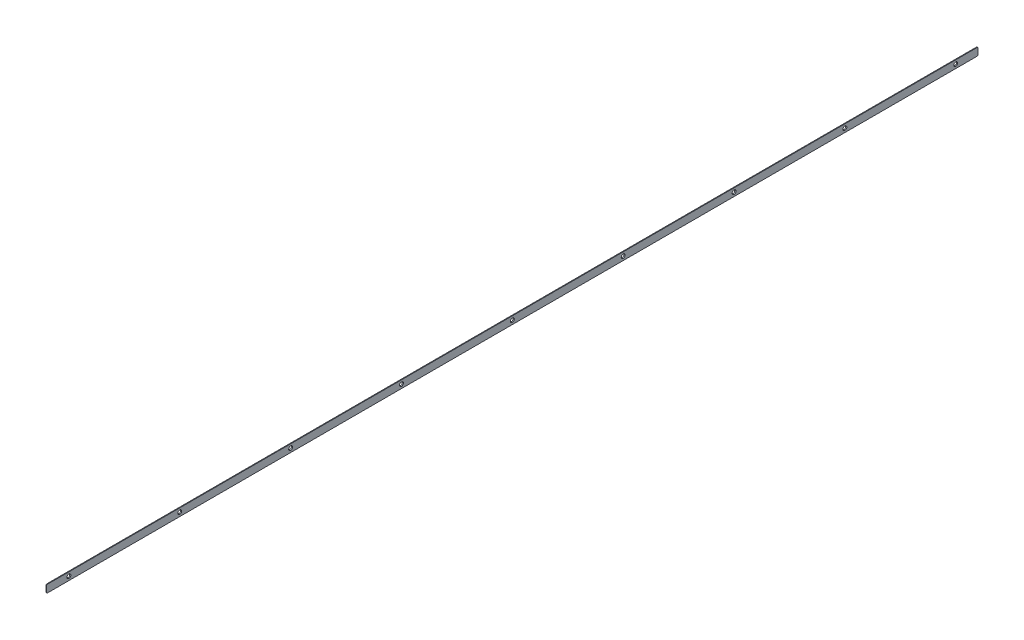
ISO-10303-21;
HEADER;
FILE_DESCRIPTION(('STEP AP214'),'2;1');
FILE_NAME('part.step','',(''),(''),'','','');
FILE_SCHEMA(('AUTOMOTIVE_DESIGN { 1 0 10303 214 1 1 1 1 }'));
ENDSEC;
DATA;
#1=APPLICATION_CONTEXT('core data for automotive mechanical design processes');
#2=APPLICATION_PROTOCOL_DEFINITION('international standard','automotive_design',2000,#1);
#3=PRODUCT_CONTEXT('',#1,'mechanical');
#4=PRODUCT('Part','Part','',(#3));
#5=PRODUCT_RELATED_PRODUCT_CATEGORY('part','',(#4));
#6=PRODUCT_DEFINITION_FORMATION('','',#4);
#7=PRODUCT_DEFINITION_CONTEXT('part definition',#1,'design');
#8=PRODUCT_DEFINITION('design','',#6,#7);
#9=PRODUCT_DEFINITION_SHAPE('','',#8);
#10=(LENGTH_UNIT() NAMED_UNIT(*) SI_UNIT(.MILLI.,.METRE.));
#11=(NAMED_UNIT(*) PLANE_ANGLE_UNIT() SI_UNIT($,.RADIAN.));
#12=(NAMED_UNIT(*) SI_UNIT($,.STERADIAN.) SOLID_ANGLE_UNIT());
#13=UNCERTAINTY_MEASURE_WITH_UNIT(LENGTH_MEASURE(1.E-05),#10,'distance_accuracy_value','');
#14=(GEOMETRIC_REPRESENTATION_CONTEXT(3) GLOBAL_UNCERTAINTY_ASSIGNED_CONTEXT((#13)) GLOBAL_UNIT_ASSIGNED_CONTEXT((#10,
#11,#12)) REPRESENTATION_CONTEXT('',''));
#15=CARTESIAN_POINT('',(0.,0.,0.));
#16=DIRECTION('',(0.,0.,1.));
#17=DIRECTION('',(1.,0.,0.));
#18=AXIS2_PLACEMENT_3D('',#15,#16,#17);
#19=CARTESIAN_POINT('',(0.,0.,0.));
#20=DIRECTION('',(1.,0.,0.));
#21=DIRECTION('',(0.,0.,-1.));
#22=AXIS2_PLACEMENT_3D('',#19,#20,#21);
#23=PLANE('',#22);
#24=CARTESIAN_POINT('',(0.,0.,-498.));
#25=DIRECTION('',(1.,0.,0.));
#26=DIRECTION('',(0.,0.,-1.));
#27=AXIS2_PLACEMENT_3D('',#24,#25,#26);
#28=CIRCLE('',#27,1.52200350578404);
#29=CARTESIAN_POINT('',(0.,0.,-499.522003505784));
#30=VERTEX_POINT('',#29);
#31=EDGE_CURVE('E222',#30,#30,#28,.T.);
#32=ORIENTED_EDGE('',*,*,#31,.T.);
#33=EDGE_LOOP('',(#32));
#34=FACE_BOUND('',#33,.T.);
#35=CARTESIAN_POINT('',(0.,0.,-249.));
#36=DIRECTION('',(1.,0.,0.));
#37=DIRECTION('',(0.,0.,-1.));
#38=AXIS2_PLACEMENT_3D('',#35,#36,#37);
#39=CIRCLE('',#38,1.52200350578404);
#40=CARTESIAN_POINT('',(0.,0.,-250.522003505784));
#41=VERTEX_POINT('',#40);
#42=EDGE_CURVE('E210',#41,#41,#39,.T.);
#43=ORIENTED_EDGE('',*,*,#42,.T.);
#44=EDGE_LOOP('',(#43));
#45=FACE_BOUND('',#44,.T.);
#46=CARTESIAN_POINT('',(0.,0.,0.));
#47=DIRECTION('',(1.,0.,0.));
#48=DIRECTION('',(0.,0.,-1.));
#49=AXIS2_PLACEMENT_3D('',#46,#47,#48);
#50=CIRCLE('',#49,1.52200350578404);
#51=CARTESIAN_POINT('',(0.,0.,-1.52200350578404));
#52=VERTEX_POINT('',#51);
#53=EDGE_CURVE('E198',#52,#52,#50,.T.);
#54=ORIENTED_EDGE('',*,*,#53,.T.);
#55=EDGE_LOOP('',(#54));
#56=FACE_BOUND('',#55,.T.);
#57=CARTESIAN_POINT('',(0.,0.,249.));
#58=DIRECTION('',(1.,0.,0.));
#59=DIRECTION('',(0.,0.,-1.));
#60=AXIS2_PLACEMENT_3D('',#57,#58,#59);
#61=CIRCLE('',#60,1.52200350578404);
#62=CARTESIAN_POINT('',(0.,0.,247.477996494216));
#63=VERTEX_POINT('',#62);
#64=EDGE_CURVE('E139',#63,#63,#61,.T.);
#65=ORIENTED_EDGE('',*,*,#64,.T.);
#66=EDGE_LOOP('',(#65));
#67=FACE_BOUND('',#66,.T.);
#68=CARTESIAN_POINT('',(0.,0.,498.));
#69=DIRECTION('',(1.,0.,0.));
#70=DIRECTION('',(0.,0.,-1.));
#71=AXIS2_PLACEMENT_3D('',#68,#69,#70);
#72=CIRCLE('',#71,1.52200350578404);
#73=CARTESIAN_POINT('',(0.,0.,496.477996494216));
#74=VERTEX_POINT('',#73);
#75=EDGE_CURVE('E130',#74,#74,#72,.T.);
#76=ORIENTED_EDGE('',*,*,#75,.T.);
#77=EDGE_LOOP('',(#76));
#78=FACE_BOUND('',#77,.T.);
#79=DIRECTION('',(0.,0.,1.));
#80=VECTOR('',#79,1.);
#81=CARTESIAN_POINT('',(0.,4.2705,523.));
#82=LINE('',#81,#80);
#83=CARTESIAN_POINT('',(0.,4.2705,-522.));
#84=VERTEX_POINT('',#83);
#85=CARTESIAN_POINT('',(0.,4.2705,522.));
#86=VERTEX_POINT('',#85);
#87=EDGE_CURVE('E115',#84,#86,#82,.T.);
#88=ORIENTED_EDGE('',*,*,#87,.F.);
#89=CARTESIAN_POINT('',(0.,3.2705,-522.));
#90=DIRECTION('',(1.,0.,0.));
#91=DIRECTION('',(0.,0.,-1.));
#92=AXIS2_PLACEMENT_3D('',#89,#90,#91);
#93=CIRCLE('',#92,1.);
#94=CARTESIAN_POINT('',(0.,3.2705,-523.));
#95=VERTEX_POINT('',#94);
#96=EDGE_CURVE('E98',#84,#95,#93,.F.);
#97=ORIENTED_EDGE('',*,*,#96,.T.);
#98=DIRECTION('',(0.,1.,0.));
#99=VECTOR('',#98,1.);
#100=CARTESIAN_POINT('',(0.,4.2705,-523.));
#101=LINE('',#100,#99);
#102=CARTESIAN_POINT('',(0.,-3.2705,-523.));
#103=VERTEX_POINT('',#102);
#104=EDGE_CURVE('E125',#103,#95,#101,.T.);
#105=ORIENTED_EDGE('',*,*,#104,.F.);
#106=CARTESIAN_POINT('',(0.,-3.2705,-522.));
#107=DIRECTION('',(1.,0.,0.));
#108=DIRECTION('',(0.,0.,-1.));
#109=AXIS2_PLACEMENT_3D('',#106,#107,#108);
#110=CIRCLE('',#109,1.);
#111=CARTESIAN_POINT('',(0.,-4.2705,-522.));
#112=VERTEX_POINT('',#111);
#113=EDGE_CURVE('E109',#103,#112,#110,.F.);
#114=ORIENTED_EDGE('',*,*,#113,.T.);
#115=DIRECTION('',(0.,0.,-1.));
#116=VECTOR('',#115,1.);
#117=CARTESIAN_POINT('',(0.,-4.2705,523.));
#118=LINE('',#117,#116);
#119=CARTESIAN_POINT('',(0.,-4.2705,522.));
#120=VERTEX_POINT('',#119);
#121=EDGE_CURVE('E128',#120,#112,#118,.T.);
#122=ORIENTED_EDGE('',*,*,#121,.F.);
#123=CARTESIAN_POINT('',(0.,-3.2705,522.));
#124=DIRECTION('',(1.,0.,0.));
#125=DIRECTION('',(0.,0.,-1.));
#126=AXIS2_PLACEMENT_3D('',#123,#124,#125);
#127=CIRCLE('',#126,1.);
#128=CARTESIAN_POINT('',(0.,-3.2705,523.));
#129=VERTEX_POINT('',#128);
#130=EDGE_CURVE('E151',#120,#129,#127,.F.);
#131=ORIENTED_EDGE('',*,*,#130,.T.);
#132=DIRECTION('',(0.,-1.,0.));
#133=VECTOR('',#132,1.);
#134=CARTESIAN_POINT('',(0.,4.2705,523.));
#135=LINE('',#134,#133);
#136=CARTESIAN_POINT('',(0.,3.2705,523.));
#137=VERTEX_POINT('',#136);
#138=EDGE_CURVE('E124',#137,#129,#135,.T.);
#139=ORIENTED_EDGE('',*,*,#138,.F.);
#140=CARTESIAN_POINT('',(0.,3.2705,522.));
#141=DIRECTION('',(1.,0.,0.));
#142=DIRECTION('',(0.,0.,-1.));
#143=AXIS2_PLACEMENT_3D('',#140,#141,#142);
#144=CIRCLE('',#143,1.);
#145=EDGE_CURVE('E119',#137,#86,#144,.F.);
#146=ORIENTED_EDGE('',*,*,#145,.T.);
#147=EDGE_LOOP('',(#88,#97,#105,#114,#122,#131,#139,#146));
#148=FACE_BOUND('',#147,.T.);
#149=CARTESIAN_POINT('',(0.,0.,373.5));
#150=DIRECTION('',(1.,0.,0.));
#151=DIRECTION('',(0.,0.,-1.));
#152=AXIS2_PLACEMENT_3D('',#149,#150,#151);
#153=CIRCLE('',#152,1.52200350578404);
#154=CARTESIAN_POINT('',(0.,0.,371.977996494216));
#155=VERTEX_POINT('',#154);
#156=EDGE_CURVE('E189',#155,#155,#153,.T.);
#157=ORIENTED_EDGE('',*,*,#156,.T.);
#158=EDGE_LOOP('',(#157));
#159=FACE_BOUND('',#158,.T.);
#160=CARTESIAN_POINT('',(0.,0.,124.5));
#161=DIRECTION('',(1.,0.,0.));
#162=DIRECTION('',(0.,0.,-1.));
#163=AXIS2_PLACEMENT_3D('',#160,#161,#162);
#164=CIRCLE('',#163,1.52200350578404);
#165=CARTESIAN_POINT('',(0.,0.,122.977996494216));
#166=VERTEX_POINT('',#165);
#167=EDGE_CURVE('E144',#166,#166,#164,.T.);
#168=ORIENTED_EDGE('',*,*,#167,.T.);
#169=EDGE_LOOP('',(#168));
#170=FACE_BOUND('',#169,.T.);
#171=CARTESIAN_POINT('',(0.,0.,-124.5));
#172=DIRECTION('',(1.,0.,0.));
#173=DIRECTION('',(0.,0.,-1.));
#174=AXIS2_PLACEMENT_3D('',#171,#172,#173);
#175=CIRCLE('',#174,1.52200350578404);
#176=CARTESIAN_POINT('',(0.,0.,-126.022003505784));
#177=VERTEX_POINT('',#176);
#178=EDGE_CURVE('E204',#177,#177,#175,.T.);
#179=ORIENTED_EDGE('',*,*,#178,.T.);
#180=EDGE_LOOP('',(#179));
#181=FACE_BOUND('',#180,.T.);
#182=CARTESIAN_POINT('',(0.,0.,-373.5));
#183=DIRECTION('',(1.,0.,0.));
#184=DIRECTION('',(0.,0.,-1.));
#185=AXIS2_PLACEMENT_3D('',#182,#183,#184);
#186=CIRCLE('',#185,1.52200350578404);
#187=CARTESIAN_POINT('',(0.,0.,-375.022003505784));
#188=VERTEX_POINT('',#187);
#189=EDGE_CURVE('E216',#188,#188,#186,.T.);
#190=ORIENTED_EDGE('',*,*,#189,.T.);
#191=EDGE_LOOP('',(#190));
#192=FACE_BOUND('',#191,.T.);
#193=ADVANCED_FACE('F32',(#34,#45,#56,#67,#78,#148,#159,#170,#181,#192),#23,.F.);
#194=CARTESIAN_POINT('',(0.762,4.2705,-523.));
#195=DIRECTION('',(0.,0.,1.));
#196=DIRECTION('',(1.,0.,0.));
#197=AXIS2_PLACEMENT_3D('',#194,#195,#196);
#198=PLANE('',#197);
#199=ORIENTED_EDGE('',*,*,#104,.T.);
#200=DIRECTION('',(-1.,0.,0.));
#201=VECTOR('',#200,1.);
#202=CARTESIAN_POINT('',(0.762,3.2705,-523.));
#203=LINE('',#202,#201);
#204=CARTESIAN_POINT('',(0.762,3.2705,-523.));
#205=VERTEX_POINT('',#204);
#206=EDGE_CURVE('E103',#95,#205,#203,.F.);
#207=ORIENTED_EDGE('',*,*,#206,.T.);
#208=DIRECTION('',(0.,1.,0.));
#209=VECTOR('',#208,1.);
#210=CARTESIAN_POINT('',(0.762,4.2705,-523.));
#211=LINE('',#210,#209);
#212=CARTESIAN_POINT('',(0.762,-3.2705,-523.));
#213=VERTEX_POINT('',#212);
#214=EDGE_CURVE('E135',#213,#205,#211,.T.);
#215=ORIENTED_EDGE('',*,*,#214,.F.);
#216=DIRECTION('',(-1.,0.,0.));
#217=VECTOR('',#216,1.);
#218=CARTESIAN_POINT('',(0.762,-3.2705,-523.));
#219=LINE('',#218,#217);
#220=EDGE_CURVE('E108',#213,#103,#219,.T.);
#221=ORIENTED_EDGE('',*,*,#220,.T.);
#222=EDGE_LOOP('',(#199,#207,#215,#221));
#223=FACE_BOUND('',#222,.T.);
#224=ADVANCED_FACE('F255',(#223),#198,.F.);
#225=CARTESIAN_POINT('',(0.762,4.2705,523.));
#226=DIRECTION('',(0.,-1.,0.));
#227=DIRECTION('',(0.,0.,-1.));
#228=AXIS2_PLACEMENT_3D('',#225,#226,#227);
#229=PLANE('',#228);
#230=DIRECTION('',(0.,0.,1.));
#231=VECTOR('',#230,1.);
#232=CARTESIAN_POINT('',(0.762,4.2705,523.));
#233=LINE('',#232,#231);
#234=CARTESIAN_POINT('',(0.762,4.2705,-522.));
#235=VERTEX_POINT('',#234);
#236=CARTESIAN_POINT('',(0.762,4.2705,522.));
#237=VERTEX_POINT('',#236);
#238=EDGE_CURVE('E118',#235,#237,#233,.T.);
#239=ORIENTED_EDGE('',*,*,#238,.F.);
#240=DIRECTION('',(-1.,0.,0.));
#241=VECTOR('',#240,1.);
#242=CARTESIAN_POINT('',(0.762,4.2705,-522.));
#243=LINE('',#242,#241);
#244=EDGE_CURVE('E102',#235,#84,#243,.T.);
#245=ORIENTED_EDGE('',*,*,#244,.T.);
#246=ORIENTED_EDGE('',*,*,#87,.T.);
#247=DIRECTION('',(-1.,0.,0.));
#248=VECTOR('',#247,1.);
#249=CARTESIAN_POINT('',(0.762,4.2705,522.));
#250=LINE('',#249,#248);
#251=EDGE_CURVE('E120',#86,#237,#250,.F.);
#252=ORIENTED_EDGE('',*,*,#251,.T.);
#253=EDGE_LOOP('',(#239,#245,#246,#252));
#254=FACE_BOUND('',#253,.T.);
#255=ADVANCED_FACE('F114',(#254),#229,.F.);
#256=CARTESIAN_POINT('',(0.762,4.2705,523.));
#257=DIRECTION('',(0.,0.,-1.));
#258=DIRECTION('',(-1.,0.,0.));
#259=AXIS2_PLACEMENT_3D('',#256,#257,#258);
#260=PLANE('',#259);
#261=ORIENTED_EDGE('',*,*,#138,.T.);
#262=DIRECTION('',(-1.,0.,0.));
#263=VECTOR('',#262,1.);
#264=CARTESIAN_POINT('',(0.762,-3.2705,523.));
#265=LINE('',#264,#263);
#266=CARTESIAN_POINT('',(0.762,-3.2705,523.));
#267=VERTEX_POINT('',#266);
#268=EDGE_CURVE('E11',#129,#267,#265,.F.);
#269=ORIENTED_EDGE('',*,*,#268,.T.);
#270=DIRECTION('',(0.,-1.,0.));
#271=VECTOR('',#270,1.);
#272=CARTESIAN_POINT('',(0.762,4.2705,523.));
#273=LINE('',#272,#271);
#274=CARTESIAN_POINT('',(0.762,3.2705,523.));
#275=VERTEX_POINT('',#274);
#276=EDGE_CURVE('E173',#275,#267,#273,.T.);
#277=ORIENTED_EDGE('',*,*,#276,.F.);
#278=DIRECTION('',(-1.,0.,0.));
#279=VECTOR('',#278,1.);
#280=CARTESIAN_POINT('',(0.762,3.2705,523.));
#281=LINE('',#280,#279);
#282=EDGE_CURVE('E40',#275,#137,#281,.T.);
#283=ORIENTED_EDGE('',*,*,#282,.T.);
#284=EDGE_LOOP('',(#261,#269,#277,#283));
#285=FACE_BOUND('',#284,.T.);
#286=ADVANCED_FACE('F171',(#285),#260,.F.);
#287=CARTESIAN_POINT('',(0.762,-4.2705,523.));
#288=DIRECTION('',(0.,1.,0.));
#289=DIRECTION('',(0.,0.,1.));
#290=AXIS2_PLACEMENT_3D('',#287,#288,#289);
#291=PLANE('',#290);
#292=ORIENTED_EDGE('',*,*,#121,.T.);
#293=DIRECTION('',(-1.,0.,0.));
#294=VECTOR('',#293,1.);
#295=CARTESIAN_POINT('',(0.762,-4.2705,-522.));
#296=LINE('',#295,#294);
#297=CARTESIAN_POINT('',(0.762,-4.2705,-522.));
#298=VERTEX_POINT('',#297);
#299=EDGE_CURVE('E47',#112,#298,#296,.F.);
#300=ORIENTED_EDGE('',*,*,#299,.T.);
#301=DIRECTION('',(0.,0.,-1.));
#302=VECTOR('',#301,1.);
#303=CARTESIAN_POINT('',(0.762,-4.2705,523.));
#304=LINE('',#303,#302);
#305=CARTESIAN_POINT('',(0.762,-4.2705,522.));
#306=VERTEX_POINT('',#305);
#307=EDGE_CURVE('E148',#306,#298,#304,.T.);
#308=ORIENTED_EDGE('',*,*,#307,.F.);
#309=DIRECTION('',(-1.,0.,0.));
#310=VECTOR('',#309,1.);
#311=CARTESIAN_POINT('',(0.762,-4.2705,522.));
#312=LINE('',#311,#310);
#313=EDGE_CURVE('E164',#306,#120,#312,.T.);
#314=ORIENTED_EDGE('',*,*,#313,.T.);
#315=EDGE_LOOP('',(#292,#300,#308,#314));
#316=FACE_BOUND('',#315,.T.);
#317=ADVANCED_FACE('F180',(#316),#291,.F.);
#318=CARTESIAN_POINT('',(0.762,0.,0.));
#319=DIRECTION('',(1.,0.,0.));
#320=DIRECTION('',(0.,0.,-1.));
#321=AXIS2_PLACEMENT_3D('',#318,#319,#320);
#322=PLANE('',#321);
#323=CARTESIAN_POINT('',(0.762,0.,-498.));
#324=DIRECTION('',(1.,0.,0.));
#325=DIRECTION('',(0.,0.,-1.));
#326=AXIS2_PLACEMENT_3D('',#323,#324,#325);
#327=CIRCLE('',#326,2.1844);
#328=CARTESIAN_POINT('',(0.762,0.,-500.1844));
#329=VERTEX_POINT('',#328);
#330=EDGE_CURVE('E225',#329,#329,#327,.T.);
#331=ORIENTED_EDGE('',*,*,#330,.F.);
#332=EDGE_LOOP('',(#331));
#333=FACE_BOUND('',#332,.T.);
#334=CARTESIAN_POINT('',(0.762,0.,-373.5));
#335=DIRECTION('',(1.,0.,0.));
#336=DIRECTION('',(0.,0.,-1.));
#337=AXIS2_PLACEMENT_3D('',#334,#335,#336);
#338=CIRCLE('',#337,2.1844);
#339=CARTESIAN_POINT('',(0.762,0.,-375.6844));
#340=VERTEX_POINT('',#339);
#341=EDGE_CURVE('E219',#340,#340,#338,.T.);
#342=ORIENTED_EDGE('',*,*,#341,.F.);
#343=EDGE_LOOP('',(#342));
#344=FACE_BOUND('',#343,.T.);
#345=CARTESIAN_POINT('',(0.762,0.,-249.));
#346=DIRECTION('',(1.,0.,0.));
#347=DIRECTION('',(0.,0.,-1.));
#348=AXIS2_PLACEMENT_3D('',#345,#346,#347);
#349=CIRCLE('',#348,2.1844);
#350=CARTESIAN_POINT('',(0.762,0.,-251.1844));
#351=VERTEX_POINT('',#350);
#352=EDGE_CURVE('E213',#351,#351,#349,.T.);
#353=ORIENTED_EDGE('',*,*,#352,.F.);
#354=EDGE_LOOP('',(#353));
#355=FACE_BOUND('',#354,.T.);
#356=CARTESIAN_POINT('',(0.762,0.,-124.5));
#357=DIRECTION('',(1.,0.,0.));
#358=DIRECTION('',(0.,0.,-1.));
#359=AXIS2_PLACEMENT_3D('',#356,#357,#358);
#360=CIRCLE('',#359,2.1844);
#361=CARTESIAN_POINT('',(0.762,0.,-126.6844));
#362=VERTEX_POINT('',#361);
#363=EDGE_CURVE('E207',#362,#362,#360,.T.);
#364=ORIENTED_EDGE('',*,*,#363,.F.);
#365=EDGE_LOOP('',(#364));
#366=FACE_BOUND('',#365,.T.);
#367=CARTESIAN_POINT('',(0.762,0.,0.));
#368=DIRECTION('',(1.,0.,0.));
#369=DIRECTION('',(0.,0.,-1.));
#370=AXIS2_PLACEMENT_3D('',#367,#368,#369);
#371=CIRCLE('',#370,2.1844);
#372=CARTESIAN_POINT('',(0.762,0.,-2.1844));
#373=VERTEX_POINT('',#372);
#374=EDGE_CURVE('E201',#373,#373,#371,.T.);
#375=ORIENTED_EDGE('',*,*,#374,.F.);
#376=EDGE_LOOP('',(#375));
#377=FACE_BOUND('',#376,.T.);
#378=CARTESIAN_POINT('',(0.762,0.,124.5));
#379=DIRECTION('',(1.,0.,0.));
#380=DIRECTION('',(0.,0.,-1.));
#381=AXIS2_PLACEMENT_3D('',#378,#379,#380);
#382=CIRCLE('',#381,2.1844);
#383=CARTESIAN_POINT('',(0.762,0.,122.3156));
#384=VERTEX_POINT('',#383);
#385=EDGE_CURVE('E147',#384,#384,#382,.T.);
#386=ORIENTED_EDGE('',*,*,#385,.F.);
#387=EDGE_LOOP('',(#386));
#388=FACE_BOUND('',#387,.T.);
#389=CARTESIAN_POINT('',(0.762,0.,249.));
#390=DIRECTION('',(1.,0.,0.));
#391=DIRECTION('',(0.,0.,-1.));
#392=AXIS2_PLACEMENT_3D('',#389,#390,#391);
#393=CIRCLE('',#392,2.1844);
#394=CARTESIAN_POINT('',(0.762,0.,246.8156));
#395=VERTEX_POINT('',#394);
#396=EDGE_CURVE('E143',#395,#395,#393,.T.);
#397=ORIENTED_EDGE('',*,*,#396,.F.);
#398=EDGE_LOOP('',(#397));
#399=FACE_BOUND('',#398,.T.);
#400=CARTESIAN_POINT('',(0.762,0.,373.5));
#401=DIRECTION('',(1.,0.,0.));
#402=DIRECTION('',(0.,0.,-1.));
#403=AXIS2_PLACEMENT_3D('',#400,#401,#402);
#404=CIRCLE('',#403,2.1844);
#405=CARTESIAN_POINT('',(0.762,0.,371.3156));
#406=VERTEX_POINT('',#405);
#407=EDGE_CURVE('E142',#406,#406,#404,.T.);
#408=ORIENTED_EDGE('',*,*,#407,.F.);
#409=EDGE_LOOP('',(#408));
#410=FACE_BOUND('',#409,.T.);
#411=CARTESIAN_POINT('',(0.762,0.,498.));
#412=DIRECTION('',(1.,0.,0.));
#413=DIRECTION('',(0.,0.,-1.));
#414=AXIS2_PLACEMENT_3D('',#411,#412,#413);
#415=CIRCLE('',#414,2.1844);
#416=CARTESIAN_POINT('',(0.762,0.,495.8156));
#417=VERTEX_POINT('',#416);
#418=EDGE_CURVE('E138',#417,#417,#415,.T.);
#419=ORIENTED_EDGE('',*,*,#418,.F.);
#420=EDGE_LOOP('',(#419));
#421=FACE_BOUND('',#420,.T.);
#422=ORIENTED_EDGE('',*,*,#214,.T.);
#423=CARTESIAN_POINT('',(0.762,3.2705,-522.));
#424=DIRECTION('',(1.,0.,0.));
#425=DIRECTION('',(0.,0.,-1.));
#426=AXIS2_PLACEMENT_3D('',#423,#424,#425);
#427=CIRCLE('',#426,1.);
#428=EDGE_CURVE('E162',#205,#235,#427,.T.);
#429=ORIENTED_EDGE('',*,*,#428,.T.);
#430=ORIENTED_EDGE('',*,*,#238,.T.);
#431=CARTESIAN_POINT('',(0.762,3.2705,522.));
#432=DIRECTION('',(1.,0.,0.));
#433=DIRECTION('',(0.,0.,-1.));
#434=AXIS2_PLACEMENT_3D('',#431,#432,#433);
#435=CIRCLE('',#434,1.);
#436=EDGE_CURVE('E157',#237,#275,#435,.T.);
#437=ORIENTED_EDGE('',*,*,#436,.T.);
#438=ORIENTED_EDGE('',*,*,#276,.T.);
#439=CARTESIAN_POINT('',(0.762,-3.2705,522.));
#440=DIRECTION('',(1.,0.,0.));
#441=DIRECTION('',(0.,0.,-1.));
#442=AXIS2_PLACEMENT_3D('',#439,#440,#441);
#443=CIRCLE('',#442,1.);
#444=EDGE_CURVE('E54',#267,#306,#443,.T.);
#445=ORIENTED_EDGE('',*,*,#444,.T.);
#446=ORIENTED_EDGE('',*,*,#307,.T.);
#447=CARTESIAN_POINT('',(0.762,-3.2705,-522.));
#448=DIRECTION('',(1.,0.,0.));
#449=DIRECTION('',(0.,0.,-1.));
#450=AXIS2_PLACEMENT_3D('',#447,#448,#449);
#451=CIRCLE('',#450,1.);
#452=EDGE_CURVE('E160',#298,#213,#451,.T.);
#453=ORIENTED_EDGE('',*,*,#452,.T.);
#454=EDGE_LOOP('',(#422,#429,#430,#437,#438,#445,#446,#453));
#455=FACE_BOUND('',#454,.T.);
#456=ADVANCED_FACE('F232',(#333,#344,#355,#366,#377,#388,#399,#410,#421,#455),#322,.T.);
#457=CARTESIAN_POINT('',(0.762,0.,498.));
#458=DIRECTION('',(1.,0.,0.));
#459=DIRECTION('',(0.,0.,-1.));
#460=AXIS2_PLACEMENT_3D('',#457,#458,#459);
#461=CONICAL_SURFACE('',#460,2.1844,0.715584993317675);
#462=ORIENTED_EDGE('',*,*,#418,.T.);
#463=EDGE_LOOP('',(#462));
#464=FACE_BOUND('',#463,.T.);
#465=ORIENTED_EDGE('',*,*,#75,.F.);
#466=EDGE_LOOP('',(#465));
#467=FACE_BOUND('',#466,.T.);
#468=ADVANCED_FACE('F235',(#464,#467),#461,.F.);
#469=CARTESIAN_POINT('',(0.762,0.,373.5));
#470=DIRECTION('',(1.,0.,0.));
#471=DIRECTION('',(0.,0.,-1.));
#472=AXIS2_PLACEMENT_3D('',#469,#470,#471);
#473=CONICAL_SURFACE('',#472,2.1844,0.715584993317675);
#474=ORIENTED_EDGE('',*,*,#407,.T.);
#475=EDGE_LOOP('',(#474));
#476=FACE_BOUND('',#475,.T.);
#477=ORIENTED_EDGE('',*,*,#156,.F.);
#478=EDGE_LOOP('',(#477));
#479=FACE_BOUND('',#478,.T.);
#480=ADVANCED_FACE('F303',(#476,#479),#473,.F.);
#481=CARTESIAN_POINT('',(0.762,0.,249.));
#482=DIRECTION('',(1.,0.,0.));
#483=DIRECTION('',(0.,0.,-1.));
#484=AXIS2_PLACEMENT_3D('',#481,#482,#483);
#485=CONICAL_SURFACE('',#484,2.1844,0.715584993317675);
#486=ORIENTED_EDGE('',*,*,#396,.T.);
#487=EDGE_LOOP('',(#486));
#488=FACE_BOUND('',#487,.T.);
#489=ORIENTED_EDGE('',*,*,#64,.F.);
#490=EDGE_LOOP('',(#489));
#491=FACE_BOUND('',#490,.T.);
#492=ADVANCED_FACE('F310',(#488,#491),#485,.F.);
#493=CARTESIAN_POINT('',(0.762,0.,124.5));
#494=DIRECTION('',(1.,0.,0.));
#495=DIRECTION('',(0.,0.,-1.));
#496=AXIS2_PLACEMENT_3D('',#493,#494,#495);
#497=CONICAL_SURFACE('',#496,2.1844,0.715584993317675);
#498=ORIENTED_EDGE('',*,*,#385,.T.);
#499=EDGE_LOOP('',(#498));
#500=FACE_BOUND('',#499,.T.);
#501=ORIENTED_EDGE('',*,*,#167,.F.);
#502=EDGE_LOOP('',(#501));
#503=FACE_BOUND('',#502,.T.);
#504=ADVANCED_FACE('F318',(#500,#503),#497,.F.);
#505=CARTESIAN_POINT('',(0.762,0.,0.));
#506=DIRECTION('',(1.,0.,0.));
#507=DIRECTION('',(0.,0.,-1.));
#508=AXIS2_PLACEMENT_3D('',#505,#506,#507);
#509=CONICAL_SURFACE('',#508,2.1844,0.715584993317675);
#510=ORIENTED_EDGE('',*,*,#374,.T.);
#511=EDGE_LOOP('',(#510));
#512=FACE_BOUND('',#511,.T.);
#513=ORIENTED_EDGE('',*,*,#53,.F.);
#514=EDGE_LOOP('',(#513));
#515=FACE_BOUND('',#514,.T.);
#516=ADVANCED_FACE('F326',(#512,#515),#509,.F.);
#517=CARTESIAN_POINT('',(0.762,0.,-124.5));
#518=DIRECTION('',(1.,0.,0.));
#519=DIRECTION('',(0.,0.,-1.));
#520=AXIS2_PLACEMENT_3D('',#517,#518,#519);
#521=CONICAL_SURFACE('',#520,2.1844,0.715584993317675);
#522=ORIENTED_EDGE('',*,*,#363,.T.);
#523=EDGE_LOOP('',(#522));
#524=FACE_BOUND('',#523,.T.);
#525=ORIENTED_EDGE('',*,*,#178,.F.);
#526=EDGE_LOOP('',(#525));
#527=FACE_BOUND('',#526,.T.);
#528=ADVANCED_FACE('F334',(#524,#527),#521,.F.);
#529=CARTESIAN_POINT('',(0.762,0.,-249.));
#530=DIRECTION('',(1.,0.,0.));
#531=DIRECTION('',(0.,0.,-1.));
#532=AXIS2_PLACEMENT_3D('',#529,#530,#531);
#533=CONICAL_SURFACE('',#532,2.1844,0.715584993317675);
#534=ORIENTED_EDGE('',*,*,#352,.T.);
#535=EDGE_LOOP('',(#534));
#536=FACE_BOUND('',#535,.T.);
#537=ORIENTED_EDGE('',*,*,#42,.F.);
#538=EDGE_LOOP('',(#537));
#539=FACE_BOUND('',#538,.T.);
#540=ADVANCED_FACE('F342',(#536,#539),#533,.F.);
#541=CARTESIAN_POINT('',(0.762,0.,-373.5));
#542=DIRECTION('',(1.,0.,0.));
#543=DIRECTION('',(0.,0.,-1.));
#544=AXIS2_PLACEMENT_3D('',#541,#542,#543);
#545=CONICAL_SURFACE('',#544,2.1844,0.715584993317675);
#546=ORIENTED_EDGE('',*,*,#341,.T.);
#547=EDGE_LOOP('',(#546));
#548=FACE_BOUND('',#547,.T.);
#549=ORIENTED_EDGE('',*,*,#189,.F.);
#550=EDGE_LOOP('',(#549));
#551=FACE_BOUND('',#550,.T.);
#552=ADVANCED_FACE('F350',(#548,#551),#545,.F.);
#553=CARTESIAN_POINT('',(0.762,0.,-498.));
#554=DIRECTION('',(1.,0.,0.));
#555=DIRECTION('',(0.,0.,-1.));
#556=AXIS2_PLACEMENT_3D('',#553,#554,#555);
#557=CONICAL_SURFACE('',#556,2.1844,0.715584993317675);
#558=ORIENTED_EDGE('',*,*,#330,.T.);
#559=EDGE_LOOP('',(#558));
#560=FACE_BOUND('',#559,.T.);
#561=ORIENTED_EDGE('',*,*,#31,.F.);
#562=EDGE_LOOP('',(#561));
#563=FACE_BOUND('',#562,.T.);
#564=ADVANCED_FACE('F229',(#560,#563),#557,.F.);
#565=CARTESIAN_POINT('',(0.762,3.2705,-522.));
#566=DIRECTION('',(-1.,0.,0.));
#567=DIRECTION('',(0.,0.,1.));
#568=AXIS2_PLACEMENT_3D('',#565,#566,#567);
#569=CYLINDRICAL_SURFACE('',#568,1.);
#570=ORIENTED_EDGE('',*,*,#428,.F.);
#571=ORIENTED_EDGE('',*,*,#206,.F.);
#572=ORIENTED_EDGE('',*,*,#96,.F.);
#573=ORIENTED_EDGE('',*,*,#244,.F.);
#574=EDGE_LOOP('',(#570,#571,#572,#573));
#575=FACE_BOUND('',#574,.T.);
#576=ADVANCED_FACE('F101',(#575),#569,.T.);
#577=CARTESIAN_POINT('',(0.762,-3.2705,-522.));
#578=DIRECTION('',(-1.,0.,0.));
#579=DIRECTION('',(0.,0.,1.));
#580=AXIS2_PLACEMENT_3D('',#577,#578,#579);
#581=CYLINDRICAL_SURFACE('',#580,1.);
#582=ORIENTED_EDGE('',*,*,#452,.F.);
#583=ORIENTED_EDGE('',*,*,#299,.F.);
#584=ORIENTED_EDGE('',*,*,#113,.F.);
#585=ORIENTED_EDGE('',*,*,#220,.F.);
#586=EDGE_LOOP('',(#582,#583,#584,#585));
#587=FACE_BOUND('',#586,.T.);
#588=ADVANCED_FACE('F257',(#587),#581,.T.);
#589=CARTESIAN_POINT('',(0.762,-3.2705,522.));
#590=DIRECTION('',(-1.,0.,0.));
#591=DIRECTION('',(0.,0.,1.));
#592=AXIS2_PLACEMENT_3D('',#589,#590,#591);
#593=CYLINDRICAL_SURFACE('',#592,1.);
#594=ORIENTED_EDGE('',*,*,#444,.F.);
#595=ORIENTED_EDGE('',*,*,#268,.F.);
#596=ORIENTED_EDGE('',*,*,#130,.F.);
#597=ORIENTED_EDGE('',*,*,#313,.F.);
#598=EDGE_LOOP('',(#594,#595,#596,#597));
#599=FACE_BOUND('',#598,.T.);
#600=ADVANCED_FACE('F179',(#599),#593,.T.);
#601=CARTESIAN_POINT('',(0.762,3.2705,522.));
#602=DIRECTION('',(-1.,0.,0.));
#603=DIRECTION('',(0.,0.,1.));
#604=AXIS2_PLACEMENT_3D('',#601,#602,#603);
#605=CYLINDRICAL_SURFACE('',#604,1.);
#606=ORIENTED_EDGE('',*,*,#436,.F.);
#607=ORIENTED_EDGE('',*,*,#251,.F.);
#608=ORIENTED_EDGE('',*,*,#145,.F.);
#609=ORIENTED_EDGE('',*,*,#282,.F.);
#610=EDGE_LOOP('',(#606,#607,#608,#609));
#611=FACE_BOUND('',#610,.T.);
#612=ADVANCED_FACE('F34',(#611),#605,.T.);
#613=CLOSED_SHELL('',(#193,#224,#255,#286,#317,#456,#468,#480,#492,#504,#516,#528,#540,#552,
#564,#576,#588,#600,#612));
#614=MANIFOLD_SOLID_BREP('B2',#613);
#615=ADVANCED_BREP_SHAPE_REPRESENTATION('',(#18,#614),#14);
#616=SHAPE_DEFINITION_REPRESENTATION(#9,#615);
ENDSEC;
END-ISO-10303-21;
